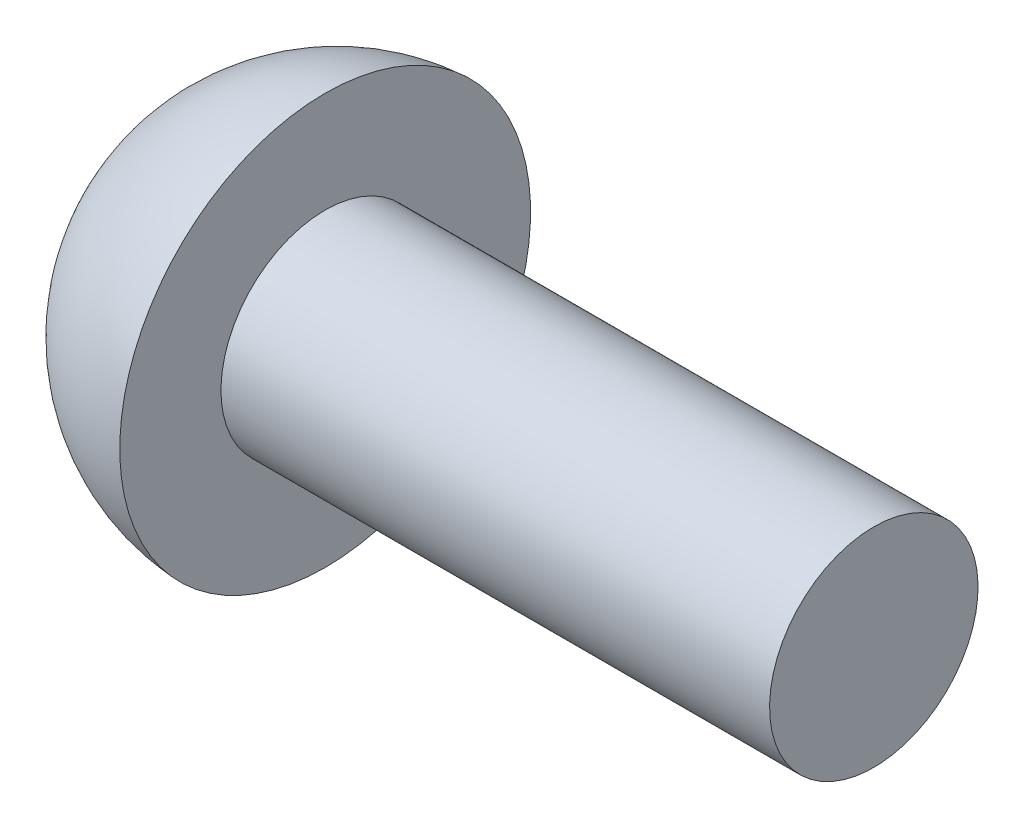
ISO-10303-21;
HEADER;
FILE_DESCRIPTION(('STEP AP214'),'2;1');
FILE_NAME('part.step','',(''),(''),'','','');
FILE_SCHEMA(('AUTOMOTIVE_DESIGN { 1 0 10303 214 1 1 1 1 }'));
ENDSEC;
DATA;
#1=APPLICATION_CONTEXT('core data for automotive mechanical design processes');
#2=APPLICATION_PROTOCOL_DEFINITION('international standard','automotive_design',2000,#1);
#3=PRODUCT_CONTEXT('',#1,'mechanical');
#4=PRODUCT('Part','Part','',(#3));
#5=PRODUCT_RELATED_PRODUCT_CATEGORY('part','',(#4));
#6=PRODUCT_DEFINITION_FORMATION('','',#4);
#7=PRODUCT_DEFINITION_CONTEXT('part definition',#1,'design');
#8=PRODUCT_DEFINITION('design','',#6,#7);
#9=PRODUCT_DEFINITION_SHAPE('','',#8);
#10=(LENGTH_UNIT() NAMED_UNIT(*) SI_UNIT(.MILLI.,.METRE.));
#11=(NAMED_UNIT(*) PLANE_ANGLE_UNIT() SI_UNIT($,.RADIAN.));
#12=(NAMED_UNIT(*) SI_UNIT($,.STERADIAN.) SOLID_ANGLE_UNIT());
#13=UNCERTAINTY_MEASURE_WITH_UNIT(LENGTH_MEASURE(1.E-05),#10,'distance_accuracy_value','');
#14=(GEOMETRIC_REPRESENTATION_CONTEXT(3) GLOBAL_UNCERTAINTY_ASSIGNED_CONTEXT((#13)) GLOBAL_UNIT_ASSIGNED_CONTEXT((#10,
#11,#12)) REPRESENTATION_CONTEXT('',''));
#15=CARTESIAN_POINT('',(0.,0.,0.));
#16=DIRECTION('',(0.,0.,1.));
#17=DIRECTION('',(1.,0.,0.));
#18=AXIS2_PLACEMENT_3D('',#15,#16,#17);
#19=CARTESIAN_POINT('',(6.35,0.,0.));
#20=DIRECTION('',(1.,0.,0.));
#21=DIRECTION('',(0.,1.,0.));
#22=AXIS2_PLACEMENT_3D('',#19,#20,#21);
#23=PLANE('',#22);
#24=CARTESIAN_POINT('',(6.35,0.,0.));
#25=DIRECTION('',(1.,0.,0.));
#26=DIRECTION('',(0.,1.,0.));
#27=AXIS2_PLACEMENT_3D('',#24,#25,#26);
#28=CIRCLE('',#27,2.413);
#29=CARTESIAN_POINT('',(6.35,2.413,0.));
#30=VERTEX_POINT('',#29);
#31=EDGE_CURVE('E10',#30,#30,#28,.T.);
#32=ORIENTED_EDGE('',*,*,#31,.T.);
#33=EDGE_LOOP('',(#32));
#34=FACE_BOUND('',#33,.T.);
#35=ADVANCED_FACE('F33',(#34),#23,.T.);
#36=CARTESIAN_POINT('',(6.35,0.,0.));
#37=DIRECTION('',(1.,0.,0.));
#38=DIRECTION('',(0.,1.,0.));
#39=AXIS2_PLACEMENT_3D('',#36,#37,#38);
#40=CYLINDRICAL_SURFACE('',#39,2.413);
#41=CARTESIAN_POINT('',(-6.35,0.,0.));
#42=DIRECTION('',(1.,0.,0.));
#43=DIRECTION('',(0.,1.,0.));
#44=AXIS2_PLACEMENT_3D('',#41,#42,#43);
#45=CIRCLE('',#44,2.413);
#46=CARTESIAN_POINT('',(-6.35,2.413,0.));
#47=VERTEX_POINT('',#46);
#48=EDGE_CURVE('E39',#47,#47,#45,.T.);
#49=ORIENTED_EDGE('',*,*,#48,.T.);
#50=EDGE_LOOP('',(#49));
#51=FACE_BOUND('',#50,.T.);
#52=ORIENTED_EDGE('',*,*,#31,.F.);
#53=EDGE_LOOP('',(#52));
#54=FACE_BOUND('',#53,.T.);
#55=ADVANCED_FACE('F59',(#51,#54),#40,.T.);
#56=CARTESIAN_POINT('',(-6.35,4.75488339209281,0.));
#57=DIRECTION('',(1.,0.,0.));
#58=DIRECTION('',(0.,1.,0.));
#59=AXIS2_PLACEMENT_3D('',#56,#57,#58);
#60=PLANE('',#59);
#61=CARTESIAN_POINT('',(-6.35,0.,0.));
#62=DIRECTION('',(1.,0.,0.));
#63=DIRECTION('',(0.,1.,0.));
#64=AXIS2_PLACEMENT_3D('',#61,#62,#63);
#65=CIRCLE('',#64,4.75488339209281);
#66=CARTESIAN_POINT('',(-6.35,4.75488339209281,0.));
#67=VERTEX_POINT('',#66);
#68=EDGE_CURVE('E43',#67,#67,#65,.T.);
#69=ORIENTED_EDGE('',*,*,#68,.T.);
#70=EDGE_LOOP('',(#69));
#71=FACE_BOUND('',#70,.T.);
#72=ORIENTED_EDGE('',*,*,#48,.F.);
#73=EDGE_LOOP('',(#72));
#74=FACE_BOUND('',#73,.T.);
#75=ADVANCED_FACE('F50',(#71,#74),#60,.T.);
#76=CARTESIAN_POINT('',(-6.08075999999997,0.,0.));
#77=DIRECTION('',(1.,0.,0.));
#78=DIRECTION('',(0.,1.,0.));
#79=AXIS2_PLACEMENT_3D('',#76,#77,#78);
#80=SPHERICAL_SURFACE('',#79,4.7625);
#81=ORIENTED_EDGE('',*,*,#68,.F.);
#82=EDGE_LOOP('',(#81));
#83=FACE_BOUND('',#82,.T.);
#84=ADVANCED_FACE('F53',(#83),#80,.T.);
#85=CLOSED_SHELL('',(#35,#55,#75,#84));
#86=MANIFOLD_SOLID_BREP('B2',#85);
#87=ADVANCED_BREP_SHAPE_REPRESENTATION('',(#18,#86),#14);
#88=SHAPE_DEFINITION_REPRESENTATION(#9,#87);
ENDSEC;
END-ISO-10303-21;
